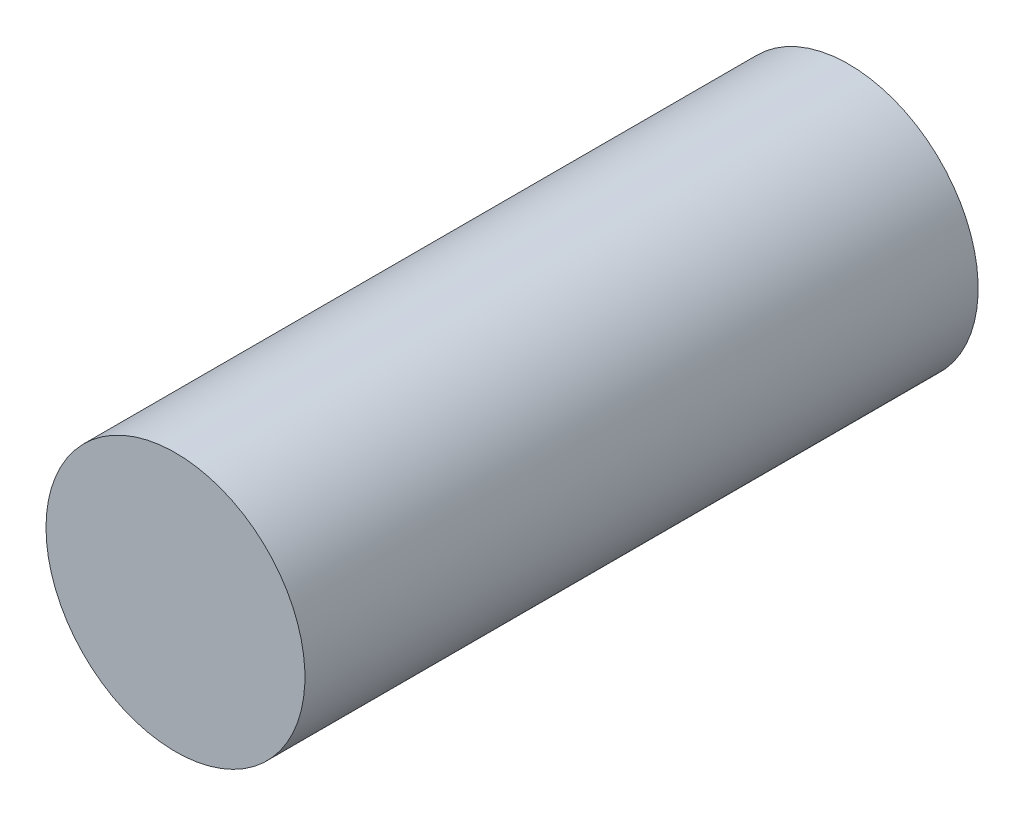
ISO-10303-21;
HEADER;
FILE_DESCRIPTION(('STEP AP214'),'2;1');
FILE_NAME('part.step','',(''),(''),'','','');
FILE_SCHEMA(('AUTOMOTIVE_DESIGN { 1 0 10303 214 1 1 1 1 }'));
ENDSEC;
DATA;
#1=APPLICATION_CONTEXT('core data for automotive mechanical design processes');
#2=APPLICATION_PROTOCOL_DEFINITION('international standard','automotive_design',2000,#1);
#3=PRODUCT_CONTEXT('',#1,'mechanical');
#4=PRODUCT('Part','Part','',(#3));
#5=PRODUCT_RELATED_PRODUCT_CATEGORY('part','',(#4));
#6=PRODUCT_DEFINITION_FORMATION('','',#4);
#7=PRODUCT_DEFINITION_CONTEXT('part definition',#1,'design');
#8=PRODUCT_DEFINITION('design','',#6,#7);
#9=PRODUCT_DEFINITION_SHAPE('','',#8);
#10=(LENGTH_UNIT() NAMED_UNIT(*) SI_UNIT(.MILLI.,.METRE.));
#11=(NAMED_UNIT(*) PLANE_ANGLE_UNIT() SI_UNIT($,.RADIAN.));
#12=(NAMED_UNIT(*) SI_UNIT($,.STERADIAN.) SOLID_ANGLE_UNIT());
#13=UNCERTAINTY_MEASURE_WITH_UNIT(LENGTH_MEASURE(1.E-05),#10,'distance_accuracy_value','');
#14=(GEOMETRIC_REPRESENTATION_CONTEXT(3) GLOBAL_UNCERTAINTY_ASSIGNED_CONTEXT((#13)) GLOBAL_UNIT_ASSIGNED_CONTEXT((#10,
#11,#12)) REPRESENTATION_CONTEXT('',''));
#15=CARTESIAN_POINT('',(0.,0.,0.));
#16=DIRECTION('',(0.,0.,1.));
#17=DIRECTION('',(1.,0.,0.));
#18=AXIS2_PLACEMENT_3D('',#15,#16,#17);
#19=CARTESIAN_POINT('',(0.15,0.,0.));
#20=DIRECTION('',(0.,0.,-1.));
#21=DIRECTION('',(-1.,0.,0.));
#22=AXIS2_PLACEMENT_3D('',#19,#20,#21);
#23=PLANE('',#22);
#24=CARTESIAN_POINT('',(0.,0.,0.));
#25=DIRECTION('',(0.,0.,-1.));
#26=DIRECTION('',(-1.,0.,0.));
#27=AXIS2_PLACEMENT_3D('',#24,#25,#26);
#28=CIRCLE('',#27,0.15);
#29=CARTESIAN_POINT('',(-0.15,0.,0.));
#30=VERTEX_POINT('',#29);
#31=EDGE_CURVE('E17',#30,#30,#28,.F.);
#32=ORIENTED_EDGE('',*,*,#31,.F.);
#33=EDGE_LOOP('',(#32));
#34=FACE_BOUND('',#33,.T.);
#35=ADVANCED_FACE('F14',(#34),#23,.T.);
#36=CARTESIAN_POINT('',(0.15,0.,0.78));
#37=DIRECTION('',(0.,0.,-1.));
#38=DIRECTION('',(-1.,0.,0.));
#39=AXIS2_PLACEMENT_3D('',#36,#37,#38);
#40=PLANE('',#39);
#41=CARTESIAN_POINT('',(0.,0.,0.78));
#42=DIRECTION('',(0.,0.,-1.));
#43=DIRECTION('',(-1.,0.,0.));
#44=AXIS2_PLACEMENT_3D('',#41,#42,#43);
#45=CIRCLE('',#44,0.15);
#46=CARTESIAN_POINT('',(-0.15,0.,0.78));
#47=VERTEX_POINT('',#46);
#48=EDGE_CURVE('E10',#47,#47,#45,.T.);
#49=ORIENTED_EDGE('',*,*,#48,.F.);
#50=EDGE_LOOP('',(#49));
#51=FACE_BOUND('',#50,.T.);
#52=ADVANCED_FACE('F29',(#51),#40,.F.);
#53=CARTESIAN_POINT('',(0.,0.,0.));
#54=DIRECTION('',(0.,0.,-1.));
#55=DIRECTION('',(-1.,0.,0.));
#56=AXIS2_PLACEMENT_3D('',#53,#54,#55);
#57=CYLINDRICAL_SURFACE('',#56,0.15);
#58=ORIENTED_EDGE('',*,*,#31,.T.);
#59=EDGE_LOOP('',(#58));
#60=FACE_BOUND('',#59,.T.);
#61=ORIENTED_EDGE('',*,*,#48,.T.);
#62=EDGE_LOOP('',(#61));
#63=FACE_BOUND('',#62,.T.);
#64=ADVANCED_FACE('F26',(#60,#63),#57,.T.);
#65=CLOSED_SHELL('',(#35,#52,#64));
#66=MANIFOLD_SOLID_BREP('B1',#65);
#67=ADVANCED_BREP_SHAPE_REPRESENTATION('',(#18,#66),#14);
#68=SHAPE_DEFINITION_REPRESENTATION(#9,#67);
ENDSEC;
END-ISO-10303-21;
